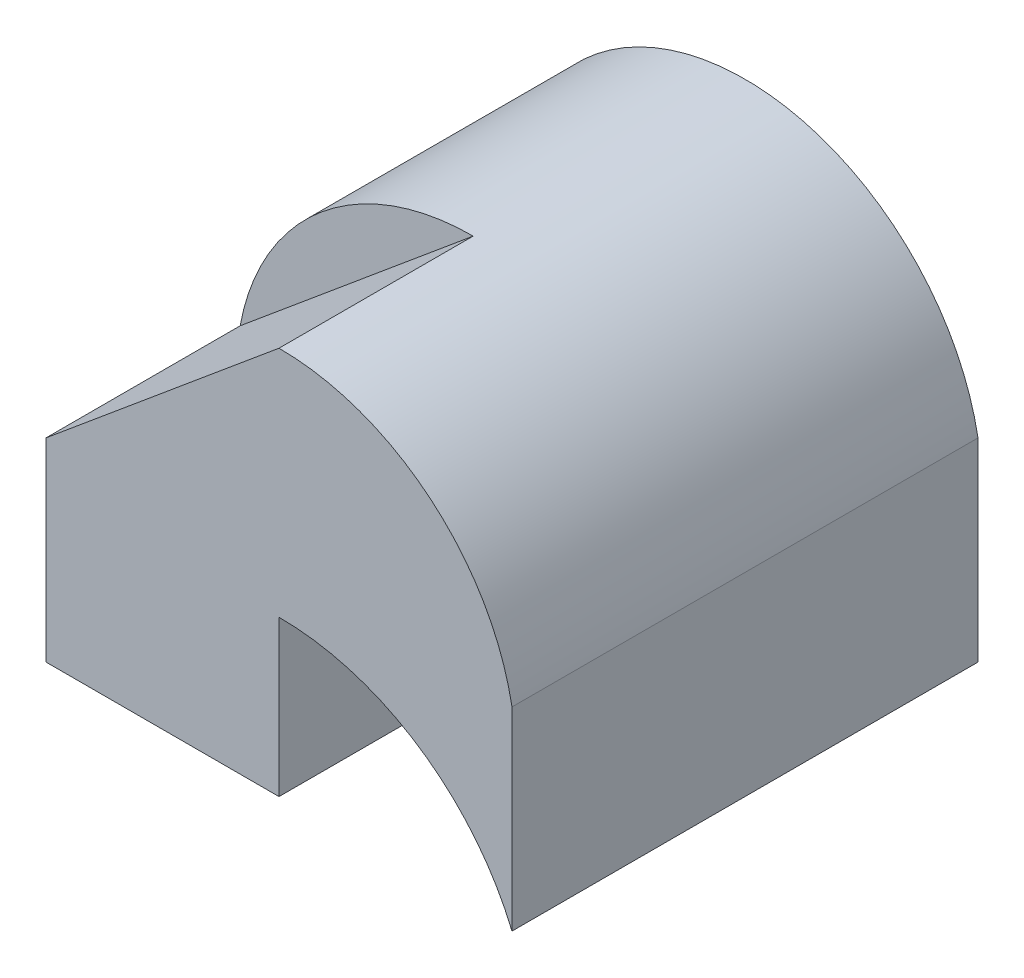
ISO-10303-21;
HEADER;
FILE_DESCRIPTION(('STEP AP214'),'2;1');
FILE_NAME('part.step','',(''),(''),'','','');
FILE_SCHEMA(('AUTOMOTIVE_DESIGN { 1 0 10303 214 1 1 1 1 }'));
ENDSEC;
DATA;
#1=APPLICATION_CONTEXT('core data for automotive mechanical design processes');
#2=APPLICATION_PROTOCOL_DEFINITION('international standard','automotive_design',2000,#1);
#3=PRODUCT_CONTEXT('',#1,'mechanical');
#4=PRODUCT('Part','Part','',(#3));
#5=PRODUCT_RELATED_PRODUCT_CATEGORY('part','',(#4));
#6=PRODUCT_DEFINITION_FORMATION('','',#4);
#7=PRODUCT_DEFINITION_CONTEXT('part definition',#1,'design');
#8=PRODUCT_DEFINITION('design','',#6,#7);
#9=PRODUCT_DEFINITION_SHAPE('','',#8);
#10=(LENGTH_UNIT() NAMED_UNIT(*) SI_UNIT(.MILLI.,.METRE.));
#11=(NAMED_UNIT(*) PLANE_ANGLE_UNIT() SI_UNIT($,.RADIAN.));
#12=(NAMED_UNIT(*) SI_UNIT($,.STERADIAN.) SOLID_ANGLE_UNIT());
#13=UNCERTAINTY_MEASURE_WITH_UNIT(LENGTH_MEASURE(1.E-05),#10,'distance_accuracy_value','');
#14=(GEOMETRIC_REPRESENTATION_CONTEXT(3) GLOBAL_UNCERTAINTY_ASSIGNED_CONTEXT((#13)) GLOBAL_UNIT_ASSIGNED_CONTEXT((#10,
#11,#12)) REPRESENTATION_CONTEXT('',''));
#15=CARTESIAN_POINT('',(0.,0.,0.));
#16=DIRECTION('',(0.,0.,1.));
#17=DIRECTION('',(1.,0.,0.));
#18=AXIS2_PLACEMENT_3D('',#15,#16,#17);
#19=CARTESIAN_POINT('',(-3.,5.,-3.));
#20=DIRECTION('',(0.,0.,1.));
#21=DIRECTION('',(1.,0.,0.));
#22=AXIS2_PLACEMENT_3D('',#19,#20,#21);
#23=PLANE('',#22);
#24=CARTESIAN_POINT('',(0.,-1.25,-3.));
#25=DIRECTION('',(0.,0.,1.));
#26=DIRECTION('',(1.,0.,0.));
#27=AXIS2_PLACEMENT_3D('',#24,#25,#26);
#28=CIRCLE('',#27,3.25);
#29=CARTESIAN_POINT('',(-3.,0.,-3.));
#30=VERTEX_POINT('',#29);
#31=CARTESIAN_POINT('',(3.,0.,-3.));
#32=VERTEX_POINT('',#31);
#33=EDGE_CURVE('E161',#30,#32,#28,.F.);
#34=ORIENTED_EDGE('',*,*,#33,.F.);
#35=DIRECTION('',(0.,-1.,0.));
#36=VECTOR('',#35,1.);
#37=CARTESIAN_POINT('',(-3.,5.,-3.));
#38=LINE('',#37,#36);
#39=CARTESIAN_POINT('',(-3.,2.5,-3.));
#40=VERTEX_POINT('',#39);
#41=EDGE_CURVE('E136',#40,#30,#38,.T.);
#42=ORIENTED_EDGE('',*,*,#41,.F.);
#43=CARTESIAN_POINT('',(0.,1.95,-3.));
#44=DIRECTION('',(0.,0.,1.));
#45=DIRECTION('',(1.,0.,0.));
#46=AXIS2_PLACEMENT_3D('',#43,#44,#45);
#47=CIRCLE('',#46,3.05);
#48=CARTESIAN_POINT('',(3.,2.5,-3.));
#49=VERTEX_POINT('',#48);
#50=EDGE_CURVE('E154',#40,#49,#47,.F.);
#51=ORIENTED_EDGE('',*,*,#50,.T.);
#52=DIRECTION('',(0.,-1.,0.));
#53=VECTOR('',#52,1.);
#54=CARTESIAN_POINT('',(3.,5.,-3.));
#55=LINE('',#54,#53);
#56=EDGE_CURVE('E134',#49,#32,#55,.T.);
#57=ORIENTED_EDGE('',*,*,#56,.T.);
#58=EDGE_LOOP('',(#34,#42,#51,#57));
#59=FACE_BOUND('',#58,.T.);
#60=ADVANCED_FACE('F51',(#59),#23,.F.);
#61=CARTESIAN_POINT('',(-3.,5.,3.));
#62=DIRECTION('',(0.,0.,-1.));
#63=DIRECTION('',(-1.,0.,0.));
#64=AXIS2_PLACEMENT_3D('',#61,#62,#63);
#65=PLANE('',#64);
#66=CARTESIAN_POINT('',(0.,1.95,3.));
#67=DIRECTION('',(0.,0.,1.));
#68=DIRECTION('',(1.,0.,0.));
#69=AXIS2_PLACEMENT_3D('',#66,#67,#68);
#70=CIRCLE('',#69,3.05);
#71=CARTESIAN_POINT('',(0.,5.,3.));
#72=VERTEX_POINT('',#71);
#73=CARTESIAN_POINT('',(3.,2.5,3.));
#74=VERTEX_POINT('',#73);
#75=EDGE_CURVE('E159',#72,#74,#70,.F.);
#76=ORIENTED_EDGE('',*,*,#75,.F.);
#77=DIRECTION('',(0.768221279597375,0.640184399664481,0.));
#78=VECTOR('',#77,1.);
#79=CARTESIAN_POINT('',(-2.45901639344262,2.95081967213115,3.));
#80=LINE('',#79,#78);
#81=CARTESIAN_POINT('',(-3.,2.5,3.));
#82=VERTEX_POINT('',#81);
#83=EDGE_CURVE('E129',#82,#72,#80,.T.);
#84=ORIENTED_EDGE('',*,*,#83,.F.);
#85=DIRECTION('',(0.,-1.,0.));
#86=VECTOR('',#85,1.);
#87=CARTESIAN_POINT('',(-3.,5.,3.));
#88=LINE('',#87,#86);
#89=CARTESIAN_POINT('',(-3.,0.,3.));
#90=VERTEX_POINT('',#89);
#91=EDGE_CURVE('E141',#82,#90,#88,.T.);
#92=ORIENTED_EDGE('',*,*,#91,.T.);
#93=DIRECTION('',(1.,0.,0.));
#94=VECTOR('',#93,1.);
#95=CARTESIAN_POINT('',(-3.,0.,3.));
#96=LINE('',#95,#94);
#97=CARTESIAN_POINT('',(0.,0.,3.));
#98=VERTEX_POINT('',#97);
#99=EDGE_CURVE('E147',#90,#98,#96,.T.);
#100=ORIENTED_EDGE('',*,*,#99,.T.);
#101=DIRECTION('',(0.,-1.,0.));
#102=VECTOR('',#101,1.);
#103=CARTESIAN_POINT('',(0.,0.,3.));
#104=LINE('',#103,#102);
#105=CARTESIAN_POINT('',(0.,2.,3.));
#106=VERTEX_POINT('',#105);
#107=EDGE_CURVE('E133',#106,#98,#104,.T.);
#108=ORIENTED_EDGE('',*,*,#107,.F.);
#109=CARTESIAN_POINT('',(0.,-1.25,3.));
#110=DIRECTION('',(0.,0.,1.));
#111=DIRECTION('',(1.,0.,0.));
#112=AXIS2_PLACEMENT_3D('',#109,#110,#111);
#113=CIRCLE('',#112,3.25);
#114=CARTESIAN_POINT('',(3.,0.,3.));
#115=VERTEX_POINT('',#114);
#116=EDGE_CURVE('E166',#106,#115,#113,.F.);
#117=ORIENTED_EDGE('',*,*,#116,.T.);
#118=DIRECTION('',(0.,-1.,0.));
#119=VECTOR('',#118,1.);
#120=CARTESIAN_POINT('',(3.,5.,3.));
#121=LINE('',#120,#119);
#122=EDGE_CURVE('E144',#74,#115,#121,.T.);
#123=ORIENTED_EDGE('',*,*,#122,.F.);
#124=EDGE_LOOP('',(#76,#84,#92,#100,#108,#117,#123));
#125=FACE_BOUND('',#124,.T.);
#126=ADVANCED_FACE('F201',(#125),#65,.F.);
#127=CARTESIAN_POINT('',(3.,5.,3.));
#128=DIRECTION('',(-1.,0.,0.));
#129=DIRECTION('',(0.,0.,1.));
#130=AXIS2_PLACEMENT_3D('',#127,#128,#129);
#131=PLANE('',#130);
#132=ORIENTED_EDGE('',*,*,#56,.F.);
#133=DIRECTION('',(0.,0.,1.));
#134=VECTOR('',#133,1.);
#135=CARTESIAN_POINT('',(3.,2.5,-9.5));
#136=LINE('',#135,#134);
#137=EDGE_CURVE('E12',#49,#74,#136,.T.);
#138=ORIENTED_EDGE('',*,*,#137,.T.);
#139=ORIENTED_EDGE('',*,*,#122,.T.);
#140=DIRECTION('',(0.,0.,-1.));
#141=VECTOR('',#140,1.);
#142=CARTESIAN_POINT('',(3.,0.,3.));
#143=LINE('',#142,#141);
#144=EDGE_CURVE('E151',#115,#32,#143,.T.);
#145=ORIENTED_EDGE('',*,*,#144,.T.);
#146=EDGE_LOOP('',(#132,#138,#139,#145));
#147=FACE_BOUND('',#146,.T.);
#148=ADVANCED_FACE('F53',(#147),#131,.F.);
#149=CARTESIAN_POINT('',(-3.,5.,3.));
#150=DIRECTION('',(1.,0.,0.));
#151=DIRECTION('',(0.,0.,-1.));
#152=AXIS2_PLACEMENT_3D('',#149,#150,#151);
#153=PLANE('',#152);
#154=ORIENTED_EDGE('',*,*,#91,.F.);
#155=DIRECTION('',(0.,0.,1.));
#156=VECTOR('',#155,1.);
#157=CARTESIAN_POINT('',(-3.,2.5,0.5));
#158=LINE('',#157,#156);
#159=CARTESIAN_POINT('',(-3.,2.5,0.5));
#160=VERTEX_POINT('',#159);
#161=EDGE_CURVE('E170',#160,#82,#158,.T.);
#162=ORIENTED_EDGE('',*,*,#161,.F.);
#163=DIRECTION('',(0.,0.,1.));
#164=VECTOR('',#163,1.);
#165=CARTESIAN_POINT('',(-3.,2.5,-9.5));
#166=LINE('',#165,#164);
#167=EDGE_CURVE('E156',#40,#160,#166,.T.);
#168=ORIENTED_EDGE('',*,*,#167,.F.);
#169=ORIENTED_EDGE('',*,*,#41,.T.);
#170=DIRECTION('',(0.,0.,1.));
#171=VECTOR('',#170,1.);
#172=CARTESIAN_POINT('',(-3.,0.,3.));
#173=LINE('',#172,#171);
#174=CARTESIAN_POINT('',(-3.,0.,0.5));
#175=VERTEX_POINT('',#174);
#176=EDGE_CURVE('E149',#30,#175,#173,.T.);
#177=ORIENTED_EDGE('',*,*,#176,.T.);
#178=EDGE_CURVE('E127',#175,#90,#173,.T.);
#179=ORIENTED_EDGE('',*,*,#178,.T.);
#180=EDGE_LOOP('',(#154,#162,#168,#169,#177,#179));
#181=FACE_BOUND('',#180,.T.);
#182=ADVANCED_FACE('F188',(#181),#153,.F.);
#183=CARTESIAN_POINT('',(0.,0.,0.));
#184=DIRECTION('',(0.,-1.,0.));
#185=DIRECTION('',(0.,0.,-1.));
#186=AXIS2_PLACEMENT_3D('',#183,#184,#185);
#187=PLANE('',#186);
#188=DIRECTION('',(-1.,0.,0.));
#189=VECTOR('',#188,1.);
#190=CARTESIAN_POINT('',(0.,0.,0.5));
#191=LINE('',#190,#189);
#192=CARTESIAN_POINT('',(0.,0.,0.5));
#193=VERTEX_POINT('',#192);
#194=EDGE_CURVE('E116',#193,#175,#191,.T.);
#195=ORIENTED_EDGE('',*,*,#194,.F.);
#196=DIRECTION('',(0.,0.,-1.));
#197=VECTOR('',#196,1.);
#198=CARTESIAN_POINT('',(0.,0.,0.));
#199=LINE('',#198,#197);
#200=EDGE_CURVE('E59',#98,#193,#199,.T.);
#201=ORIENTED_EDGE('',*,*,#200,.F.);
#202=ORIENTED_EDGE('',*,*,#99,.F.);
#203=ORIENTED_EDGE('',*,*,#178,.F.);
#204=EDGE_LOOP('',(#195,#201,#202,#203));
#205=FACE_BOUND('',#204,.T.);
#206=ADVANCED_FACE('F124',(#205),#187,.T.);
#207=CARTESIAN_POINT('',(0.,1.95,-9.5));
#208=DIRECTION('',(0.,0.,1.));
#209=DIRECTION('',(1.,0.,0.));
#210=AXIS2_PLACEMENT_3D('',#207,#208,#209);
#211=CYLINDRICAL_SURFACE('',#210,3.05);
#212=CARTESIAN_POINT('',(0.,1.95,0.5));
#213=DIRECTION('',(0.,0.,1.));
#214=DIRECTION('',(1.,0.,0.));
#215=AXIS2_PLACEMENT_3D('',#212,#213,#214);
#216=CIRCLE('',#215,3.05);
#217=CARTESIAN_POINT('',(0.,5.,0.5));
#218=VERTEX_POINT('',#217);
#219=EDGE_CURVE('E175',#218,#160,#216,.T.);
#220=ORIENTED_EDGE('',*,*,#219,.F.);
#221=DIRECTION('',(0.,0.,1.));
#222=VECTOR('',#221,1.);
#223=CARTESIAN_POINT('',(0.,5.,0.5));
#224=LINE('',#223,#222);
#225=EDGE_CURVE('E169',#218,#72,#224,.T.);
#226=ORIENTED_EDGE('',*,*,#225,.T.);
#227=ORIENTED_EDGE('',*,*,#75,.T.);
#228=ORIENTED_EDGE('',*,*,#137,.F.);
#229=ORIENTED_EDGE('',*,*,#50,.F.);
#230=ORIENTED_EDGE('',*,*,#167,.T.);
#231=EDGE_LOOP('',(#220,#226,#227,#228,#229,#230));
#232=FACE_BOUND('',#231,.T.);
#233=ADVANCED_FACE('F190',(#232),#211,.T.);
#234=CARTESIAN_POINT('',(0.,-1.25,-9.5));
#235=DIRECTION('',(0.,0.,1.));
#236=DIRECTION('',(1.,0.,0.));
#237=AXIS2_PLACEMENT_3D('',#234,#235,#236);
#238=CYLINDRICAL_SURFACE('',#237,3.25);
#239=ORIENTED_EDGE('',*,*,#33,.T.);
#240=ORIENTED_EDGE('',*,*,#144,.F.);
#241=ORIENTED_EDGE('',*,*,#116,.F.);
#242=DIRECTION('',(0.,0.,1.));
#243=VECTOR('',#242,1.);
#244=CARTESIAN_POINT('',(0.,2.,-9.5));
#245=LINE('',#244,#243);
#246=CARTESIAN_POINT('',(0.,2.,0.5));
#247=VERTEX_POINT('',#246);
#248=EDGE_CURVE('E163',#247,#106,#245,.T.);
#249=ORIENTED_EDGE('',*,*,#248,.F.);
#250=CARTESIAN_POINT('',(0.,-1.25,0.5));
#251=DIRECTION('',(0.,0.,-1.));
#252=DIRECTION('',(1.,0.,0.));
#253=AXIS2_PLACEMENT_3D('',#250,#251,#252);
#254=CIRCLE('',#253,3.25);
#255=EDGE_CURVE('E66',#175,#247,#254,.T.);
#256=ORIENTED_EDGE('',*,*,#255,.F.);
#257=ORIENTED_EDGE('',*,*,#176,.F.);
#258=EDGE_LOOP('',(#239,#240,#241,#249,#256,#257));
#259=FACE_BOUND('',#258,.T.);
#260=ADVANCED_FACE('F196',(#259),#238,.F.);
#261=CARTESIAN_POINT('',(0.,0.,-9.5));
#262=DIRECTION('',(-1.,0.,0.));
#263=DIRECTION('',(0.,-1.,0.));
#264=AXIS2_PLACEMENT_3D('',#261,#262,#263);
#265=PLANE('',#264);
#266=ORIENTED_EDGE('',*,*,#200,.T.);
#267=DIRECTION('',(0.,-1.,0.));
#268=VECTOR('',#267,1.);
#269=CARTESIAN_POINT('',(0.,2.,0.5));
#270=LINE('',#269,#268);
#271=EDGE_CURVE('E113',#247,#193,#270,.T.);
#272=ORIENTED_EDGE('',*,*,#271,.F.);
#273=ORIENTED_EDGE('',*,*,#248,.T.);
#274=ORIENTED_EDGE('',*,*,#107,.T.);
#275=EDGE_LOOP('',(#266,#272,#273,#274));
#276=FACE_BOUND('',#275,.T.);
#277=ADVANCED_FACE('F131',(#276),#265,.F.);
#278=CARTESIAN_POINT('',(-2.45901639344262,2.95081967213115,0.5));
#279=DIRECTION('',(0.640184399664481,-0.768221279597375,0.));
#280=DIRECTION('',(0.768221279597375,0.640184399664481,0.));
#281=AXIS2_PLACEMENT_3D('',#278,#279,#280);
#282=PLANE('',#281);
#283=ORIENTED_EDGE('',*,*,#83,.T.);
#284=ORIENTED_EDGE('',*,*,#225,.F.);
#285=DIRECTION('',(0.768221279597375,0.640184399664481,0.));
#286=VECTOR('',#285,1.);
#287=CARTESIAN_POINT('',(-2.45901639344262,2.95081967213115,0.5));
#288=LINE('',#287,#286);
#289=EDGE_CURVE('E73',#160,#218,#288,.T.);
#290=ORIENTED_EDGE('',*,*,#289,.F.);
#291=ORIENTED_EDGE('',*,*,#161,.T.);
#292=EDGE_LOOP('',(#283,#284,#290,#291));
#293=FACE_BOUND('',#292,.T.);
#294=ADVANCED_FACE('F183',(#293),#282,.F.);
#295=CARTESIAN_POINT('',(0.,0.,0.5));
#296=DIRECTION('',(0.,0.,1.));
#297=DIRECTION('',(1.,0.,0.));
#298=AXIS2_PLACEMENT_3D('',#295,#296,#297);
#299=PLANE('',#298);
#300=ORIENTED_EDGE('',*,*,#219,.T.);
#301=ORIENTED_EDGE('',*,*,#289,.T.);
#302=EDGE_LOOP('',(#300,#301));
#303=FACE_BOUND('',#302,.T.);
#304=ADVANCED_FACE('F179',(#303),#299,.T.);
#305=CARTESIAN_POINT('',(0.,-1.25,0.5));
#306=DIRECTION('',(0.,0.,1.));
#307=DIRECTION('',(1.,0.,0.));
#308=AXIS2_PLACEMENT_3D('',#305,#306,#307);
#309=PLANE('',#308);
#310=ORIENTED_EDGE('',*,*,#255,.T.);
#311=ORIENTED_EDGE('',*,*,#271,.T.);
#312=ORIENTED_EDGE('',*,*,#194,.T.);
#313=EDGE_LOOP('',(#310,#311,#312));
#314=FACE_BOUND('',#313,.T.);
#315=ADVANCED_FACE('F115',(#314),#309,.F.);
#316=CLOSED_SHELL('',(#60,#126,#148,#182,#206,#233,#260,#277,#294,#304,#315));
#317=MANIFOLD_SOLID_BREP('B2',#316);
#318=ADVANCED_BREP_SHAPE_REPRESENTATION('',(#18,#317),#14);
#319=SHAPE_DEFINITION_REPRESENTATION(#9,#318);
ENDSEC;
END-ISO-10303-21;
